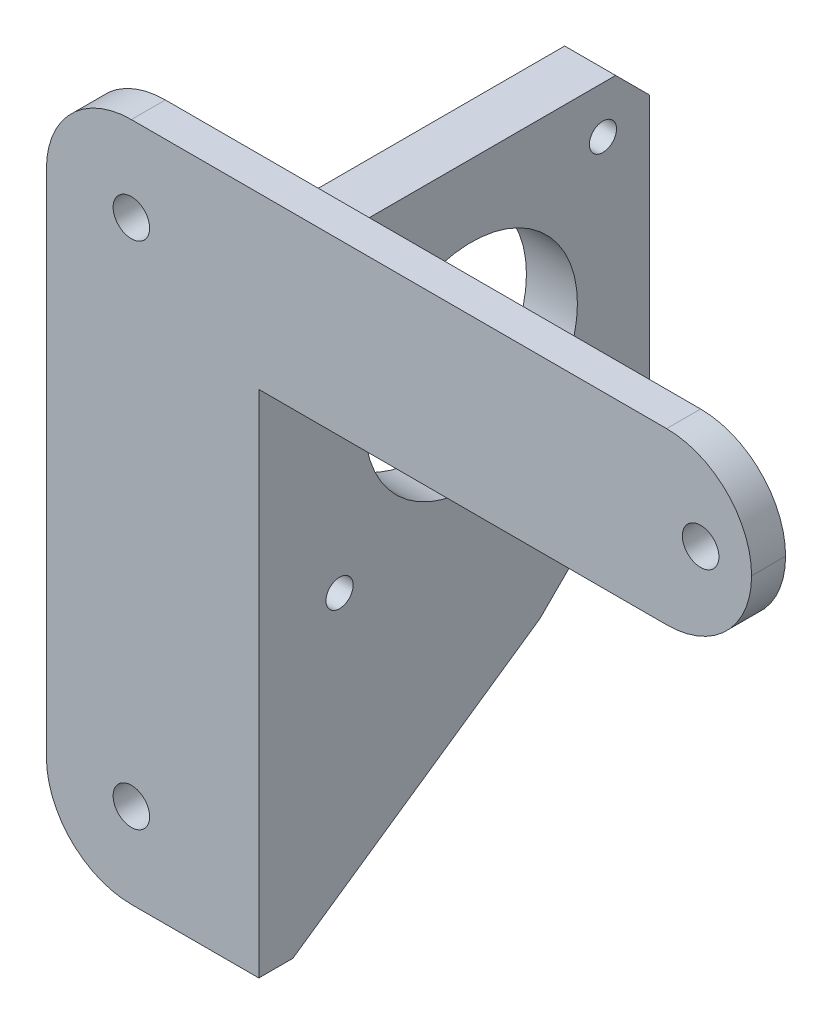
ISO-10303-21;
HEADER;
FILE_DESCRIPTION(('STEP AP214'),'2;1');
FILE_NAME('part.step','',(''),(''),'','','');
FILE_SCHEMA(('AUTOMOTIVE_DESIGN { 1 0 10303 214 1 1 1 1 }'));
ENDSEC;
DATA;
#1=APPLICATION_CONTEXT('core data for automotive mechanical design processes');
#2=APPLICATION_PROTOCOL_DEFINITION('international standard','automotive_design',2000,#1);
#3=PRODUCT_CONTEXT('',#1,'mechanical');
#4=PRODUCT('Part','Part','',(#3));
#5=PRODUCT_RELATED_PRODUCT_CATEGORY('part','',(#4));
#6=PRODUCT_DEFINITION_FORMATION('','',#4);
#7=PRODUCT_DEFINITION_CONTEXT('part definition',#1,'design');
#8=PRODUCT_DEFINITION('design','',#6,#7);
#9=PRODUCT_DEFINITION_SHAPE('','',#8);
#10=(LENGTH_UNIT() NAMED_UNIT(*) SI_UNIT(.MILLI.,.METRE.));
#11=(NAMED_UNIT(*) PLANE_ANGLE_UNIT() SI_UNIT($,.RADIAN.));
#12=(NAMED_UNIT(*) SI_UNIT($,.STERADIAN.) SOLID_ANGLE_UNIT());
#13=UNCERTAINTY_MEASURE_WITH_UNIT(LENGTH_MEASURE(1.E-05),#10,'distance_accuracy_value','');
#14=(GEOMETRIC_REPRESENTATION_CONTEXT(3) GLOBAL_UNCERTAINTY_ASSIGNED_CONTEXT((#13)) GLOBAL_UNIT_ASSIGNED_CONTEXT((#10,
#11,#12)) REPRESENTATION_CONTEXT('',''));
#15=CARTESIAN_POINT('',(0.,0.,0.));
#16=DIRECTION('',(0.,0.,1.));
#17=DIRECTION('',(1.,0.,0.));
#18=AXIS2_PLACEMENT_3D('',#15,#16,#17);
#19=CARTESIAN_POINT('',(0.,0.,0.));
#20=DIRECTION('',(0.,0.,1.));
#21=DIRECTION('',(1.,0.,0.));
#22=AXIS2_PLACEMENT_3D('',#19,#20,#21);
#23=PLANE('',#22);
#24=CARTESIAN_POINT('',(10.,-10.,0.));
#25=DIRECTION('',(0.,0.,1.));
#26=DIRECTION('',(1.,0.,0.));
#27=AXIS2_PLACEMENT_3D('',#24,#25,#26);
#28=CIRCLE('',#27,2.15);
#29=CARTESIAN_POINT('',(12.15,-10.,0.));
#30=VERTEX_POINT('',#29);
#31=EDGE_CURVE('E391',#30,#30,#28,.T.);
#32=ORIENTED_EDGE('',*,*,#31,.T.);
#33=EDGE_LOOP('',(#32));
#34=FACE_BOUND('',#33,.T.);
#35=CARTESIAN_POINT('',(10.,-70.,0.));
#36=DIRECTION('',(0.,0.,1.));
#37=DIRECTION('',(1.,0.,0.));
#38=AXIS2_PLACEMENT_3D('',#35,#36,#37);
#39=CIRCLE('',#38,2.15);
#40=CARTESIAN_POINT('',(12.15,-70.,0.));
#41=VERTEX_POINT('',#40);
#42=EDGE_CURVE('E387',#41,#41,#39,.T.);
#43=ORIENTED_EDGE('',*,*,#42,.T.);
#44=EDGE_LOOP('',(#43));
#45=FACE_BOUND('',#44,.T.);
#46=CARTESIAN_POINT('',(77.,-10.,0.));
#47=DIRECTION('',(0.,0.,1.));
#48=DIRECTION('',(1.,0.,0.));
#49=AXIS2_PLACEMENT_3D('',#46,#47,#48);
#50=CIRCLE('',#49,2.15);
#51=CARTESIAN_POINT('',(79.15,-10.,0.));
#52=VERTEX_POINT('',#51);
#53=EDGE_CURVE('E382',#52,#52,#50,.T.);
#54=ORIENTED_EDGE('',*,*,#53,.T.);
#55=EDGE_LOOP('',(#54));
#56=FACE_BOUND('',#55,.T.);
#57=DIRECTION('',(1.,0.,0.));
#58=VECTOR('',#57,1.);
#59=CARTESIAN_POINT('',(0.,-80.,0.));
#60=LINE('',#59,#58);
#61=CARTESIAN_POINT('',(10.,-80.,0.));
#62=VERTEX_POINT('',#61);
#63=CARTESIAN_POINT('',(17.,-80.,0.));
#64=VERTEX_POINT('',#63);
#65=EDGE_CURVE('E179',#62,#64,#60,.T.);
#66=ORIENTED_EDGE('',*,*,#65,.F.);
#67=CARTESIAN_POINT('',(10.,-70.,0.));
#68=DIRECTION('',(0.,0.,1.));
#69=DIRECTION('',(1.,0.,0.));
#70=AXIS2_PLACEMENT_3D('',#67,#68,#69);
#71=CIRCLE('',#70,10.);
#72=CARTESIAN_POINT('',(0.,-70.,0.));
#73=VERTEX_POINT('',#72);
#74=EDGE_CURVE('E244',#62,#73,#71,.F.);
#75=ORIENTED_EDGE('',*,*,#74,.T.);
#76=DIRECTION('',(0.,-1.,0.));
#77=VECTOR('',#76,1.);
#78=CARTESIAN_POINT('',(0.,0.,0.));
#79=LINE('',#78,#77);
#80=CARTESIAN_POINT('',(0.,-10.,0.));
#81=VERTEX_POINT('',#80);
#82=EDGE_CURVE('E222',#81,#73,#79,.T.);
#83=ORIENTED_EDGE('',*,*,#82,.F.);
#84=CARTESIAN_POINT('',(10.,-10.,0.));
#85=DIRECTION('',(0.,0.,1.));
#86=DIRECTION('',(1.,0.,0.));
#87=AXIS2_PLACEMENT_3D('',#84,#85,#86);
#88=CIRCLE('',#87,10.);
#89=CARTESIAN_POINT('',(9.99999999999999,0.,0.));
#90=VERTEX_POINT('',#89);
#91=EDGE_CURVE('E242',#81,#90,#88,.F.);
#92=ORIENTED_EDGE('',*,*,#91,.T.);
#93=DIRECTION('',(-1.,0.,0.));
#94=VECTOR('',#93,1.);
#95=CARTESIAN_POINT('',(83.,0.,0.));
#96=LINE('',#95,#94);
#97=CARTESIAN_POINT('',(73.,0.,0.));
#98=VERTEX_POINT('',#97);
#99=EDGE_CURVE('E180',#98,#90,#96,.T.);
#100=ORIENTED_EDGE('',*,*,#99,.F.);
#101=CARTESIAN_POINT('',(73.,-10.,0.));
#102=DIRECTION('',(0.,0.,1.));
#103=DIRECTION('',(1.,0.,0.));
#104=AXIS2_PLACEMENT_3D('',#101,#102,#103);
#105=CIRCLE('',#104,10.);
#106=CARTESIAN_POINT('',(83.,-10.,0.));
#107=VERTEX_POINT('',#106);
#108=EDGE_CURVE('E236',#98,#107,#105,.F.);
#109=ORIENTED_EDGE('',*,*,#108,.T.);
#110=CARTESIAN_POINT('',(73.,-10.,0.));
#111=DIRECTION('',(0.,0.,1.));
#112=DIRECTION('',(1.,0.,0.));
#113=AXIS2_PLACEMENT_3D('',#110,#111,#112);
#114=CIRCLE('',#113,10.);
#115=CARTESIAN_POINT('',(73.,-20.,0.));
#116=VERTEX_POINT('',#115);
#117=EDGE_CURVE('E239',#107,#116,#114,.F.);
#118=ORIENTED_EDGE('',*,*,#117,.T.);
#119=DIRECTION('',(1.,0.,0.));
#120=VECTOR('',#119,1.);
#121=CARTESIAN_POINT('',(25.,-20.,0.));
#122=LINE('',#121,#120);
#123=CARTESIAN_POINT('',(25.,-20.,0.));
#124=VERTEX_POINT('',#123);
#125=EDGE_CURVE('E213',#124,#116,#122,.T.);
#126=ORIENTED_EDGE('',*,*,#125,.F.);
#127=DIRECTION('',(0.,-1.,0.));
#128=VECTOR('',#127,1.);
#129=CARTESIAN_POINT('',(25.,-80.,0.));
#130=LINE('',#129,#128);
#131=CARTESIAN_POINT('',(25.,-7.,0.));
#132=VERTEX_POINT('',#131);
#133=EDGE_CURVE('E170',#132,#124,#130,.T.);
#134=ORIENTED_EDGE('',*,*,#133,.F.);
#135=DIRECTION('',(1.,0.,0.));
#136=VECTOR('',#135,1.);
#137=CARTESIAN_POINT('',(0.,-7.,0.));
#138=LINE('',#137,#136);
#139=CARTESIAN_POINT('',(17.,-7.,0.));
#140=VERTEX_POINT('',#139);
#141=EDGE_CURVE('E187',#132,#140,#138,.F.);
#142=ORIENTED_EDGE('',*,*,#141,.T.);
#143=DIRECTION('',(0.,-1.,0.));
#144=VECTOR('',#143,1.);
#145=CARTESIAN_POINT('',(17.,0.,0.));
#146=LINE('',#145,#144);
#147=EDGE_CURVE('E190',#140,#64,#146,.T.);
#148=ORIENTED_EDGE('',*,*,#147,.T.);
#149=EDGE_LOOP('',(#66,#75,#83,#92,#100,#109,#118,#126,#134,#142,#148));
#150=FACE_BOUND('',#149,.T.);
#151=ADVANCED_FACE('F39',(#34,#45,#56,#150),#23,.F.);
#152=CARTESIAN_POINT('',(83.,0.,4.));
#153=DIRECTION('',(0.,-1.,0.));
#154=DIRECTION('',(0.,0.,-1.));
#155=AXIS2_PLACEMENT_3D('',#152,#153,#154);
#156=PLANE('',#155);
#157=ORIENTED_EDGE('',*,*,#99,.T.);
#158=DIRECTION('',(0.,0.,-1.));
#159=VECTOR('',#158,1.);
#160=CARTESIAN_POINT('',(9.99999999999999,0.,4.));
#161=LINE('',#160,#159);
#162=CARTESIAN_POINT('',(9.99999999999999,0.,4.));
#163=VERTEX_POINT('',#162);
#164=EDGE_CURVE('E11',#90,#163,#161,.F.);
#165=ORIENTED_EDGE('',*,*,#164,.T.);
#166=DIRECTION('',(-1.,0.,0.));
#167=VECTOR('',#166,1.);
#168=CARTESIAN_POINT('',(83.,0.,4.));
#169=LINE('',#168,#167);
#170=CARTESIAN_POINT('',(73.,0.,4.));
#171=VERTEX_POINT('',#170);
#172=EDGE_CURVE('E208',#171,#163,#169,.T.);
#173=ORIENTED_EDGE('',*,*,#172,.F.);
#174=DIRECTION('',(0.,0.,-1.));
#175=VECTOR('',#174,1.);
#176=CARTESIAN_POINT('',(73.,0.,4.));
#177=LINE('',#176,#175);
#178=EDGE_CURVE('E48',#171,#98,#177,.T.);
#179=ORIENTED_EDGE('',*,*,#178,.T.);
#180=EDGE_LOOP('',(#157,#165,#173,#179));
#181=FACE_BOUND('',#180,.T.);
#182=ADVANCED_FACE('F269',(#181),#156,.F.);
#183=CARTESIAN_POINT('',(0.,0.,4.));
#184=DIRECTION('',(1.,0.,0.));
#185=DIRECTION('',(0.,0.,-1.));
#186=AXIS2_PLACEMENT_3D('',#183,#184,#185);
#187=PLANE('',#186);
#188=ORIENTED_EDGE('',*,*,#82,.T.);
#189=DIRECTION('',(0.,0.,-1.));
#190=VECTOR('',#189,1.);
#191=CARTESIAN_POINT('',(0.,-70.,4.));
#192=LINE('',#191,#190);
#193=CARTESIAN_POINT('',(0.,-70.,4.));
#194=VERTEX_POINT('',#193);
#195=EDGE_CURVE('E262',#73,#194,#192,.F.);
#196=ORIENTED_EDGE('',*,*,#195,.T.);
#197=DIRECTION('',(0.,-1.,0.));
#198=VECTOR('',#197,1.);
#199=CARTESIAN_POINT('',(0.,0.,4.));
#200=LINE('',#199,#198);
#201=CARTESIAN_POINT('',(0.,-10.,4.));
#202=VERTEX_POINT('',#201);
#203=EDGE_CURVE('E212',#202,#194,#200,.T.);
#204=ORIENTED_EDGE('',*,*,#203,.F.);
#205=DIRECTION('',(0.,0.,-1.));
#206=VECTOR('',#205,1.);
#207=CARTESIAN_POINT('',(0.,-10.,4.));
#208=LINE('',#207,#206);
#209=EDGE_CURVE('E260',#202,#81,#208,.T.);
#210=ORIENTED_EDGE('',*,*,#209,.T.);
#211=EDGE_LOOP('',(#188,#196,#204,#210));
#212=FACE_BOUND('',#211,.T.);
#213=ADVANCED_FACE('F433',(#212),#187,.F.);
#214=CARTESIAN_POINT('',(0.,-80.,4.));
#215=DIRECTION('',(0.,1.,0.));
#216=DIRECTION('',(0.,0.,1.));
#217=AXIS2_PLACEMENT_3D('',#214,#215,#216);
#218=PLANE('',#217);
#219=DIRECTION('',(1.,0.,0.));
#220=VECTOR('',#219,1.);
#221=CARTESIAN_POINT('',(0.,-80.,4.));
#222=LINE('',#221,#220);
#223=CARTESIAN_POINT('',(10.,-80.,4.));
#224=VERTEX_POINT('',#223);
#225=CARTESIAN_POINT('',(25.,-80.,4.));
#226=VERTEX_POINT('',#225);
#227=EDGE_CURVE('E215',#224,#226,#222,.T.);
#228=ORIENTED_EDGE('',*,*,#227,.F.);
#229=DIRECTION('',(0.,0.,-1.));
#230=VECTOR('',#229,1.);
#231=CARTESIAN_POINT('',(10.,-80.,4.));
#232=LINE('',#231,#230);
#233=EDGE_CURVE('E258',#224,#62,#232,.T.);
#234=ORIENTED_EDGE('',*,*,#233,.T.);
#235=ORIENTED_EDGE('',*,*,#65,.T.);
#236=DIRECTION('',(1.,0.,0.));
#237=VECTOR('',#236,1.);
#238=CARTESIAN_POINT('',(19.,-80.,0.));
#239=LINE('',#238,#237);
#240=CARTESIAN_POINT('',(25.,-80.,0.));
#241=VERTEX_POINT('',#240);
#242=EDGE_CURVE('E163',#64,#241,#239,.T.);
#243=ORIENTED_EDGE('',*,*,#242,.T.);
#244=DIRECTION('',(0.,0.,-1.));
#245=VECTOR('',#244,1.);
#246=CARTESIAN_POINT('',(25.,-80.,4.));
#247=LINE('',#246,#245);
#248=EDGE_CURVE('E175',#226,#241,#247,.T.);
#249=ORIENTED_EDGE('',*,*,#248,.F.);
#250=EDGE_LOOP('',(#228,#234,#235,#243,#249));
#251=FACE_BOUND('',#250,.T.);
#252=ADVANCED_FACE('F174',(#251),#218,.F.);
#253=CARTESIAN_POINT('',(25.,-80.,4.));
#254=DIRECTION('',(-1.,0.,0.));
#255=DIRECTION('',(0.,0.,1.));
#256=AXIS2_PLACEMENT_3D('',#253,#254,#255);
#257=PLANE('',#256);
#258=CARTESIAN_POINT('',(25.,-14.5,-5.50000000000001));
#259=DIRECTION('',(1.,0.,0.));
#260=DIRECTION('',(0.,0.,-1.));
#261=AXIS2_PLACEMENT_3D('',#258,#259,#260);
#262=CIRCLE('',#261,1.59999999999999);
#263=CARTESIAN_POINT('',(25.,-14.5,-7.1));
#264=VERTEX_POINT('',#263);
#265=EDGE_CURVE('E379',#264,#264,#262,.T.);
#266=ORIENTED_EDGE('',*,*,#265,.F.);
#267=EDGE_LOOP('',(#266));
#268=FACE_BOUND('',#267,.T.);
#269=CARTESIAN_POINT('',(25.,-14.5,-36.5));
#270=DIRECTION('',(1.,0.,0.));
#271=DIRECTION('',(0.,0.,-1.));
#272=AXIS2_PLACEMENT_3D('',#269,#270,#271);
#273=CIRCLE('',#272,1.59999999999999);
#274=CARTESIAN_POINT('',(25.,-14.5,-38.1));
#275=VERTEX_POINT('',#274);
#276=EDGE_CURVE('E373',#275,#275,#273,.T.);
#277=ORIENTED_EDGE('',*,*,#276,.F.);
#278=EDGE_LOOP('',(#277));
#279=FACE_BOUND('',#278,.T.);
#280=CARTESIAN_POINT('',(25.,-45.5,-36.5));
#281=DIRECTION('',(1.,0.,0.));
#282=DIRECTION('',(0.,0.,-1.));
#283=AXIS2_PLACEMENT_3D('',#280,#281,#282);
#284=CIRCLE('',#283,1.59999999999999);
#285=CARTESIAN_POINT('',(25.,-45.5,-38.1));
#286=VERTEX_POINT('',#285);
#287=EDGE_CURVE('E367',#286,#286,#284,.T.);
#288=ORIENTED_EDGE('',*,*,#287,.F.);
#289=EDGE_LOOP('',(#288));
#290=FACE_BOUND('',#289,.T.);
#291=CARTESIAN_POINT('',(25.,-45.5,-5.50000000000001));
#292=DIRECTION('',(1.,0.,0.));
#293=DIRECTION('',(0.,0.,-1.));
#294=AXIS2_PLACEMENT_3D('',#291,#292,#293);
#295=CIRCLE('',#294,1.59999999999999);
#296=CARTESIAN_POINT('',(25.,-45.5,-7.1));
#297=VERTEX_POINT('',#296);
#298=EDGE_CURVE('E361',#297,#297,#295,.T.);
#299=ORIENTED_EDGE('',*,*,#298,.F.);
#300=EDGE_LOOP('',(#299));
#301=FACE_BOUND('',#300,.T.);
#302=DIRECTION('',(0.,0.568190717082642,-0.822896900602447));
#303=VECTOR('',#302,1.);
#304=CARTESIAN_POINT('',(25.,-51.,-42.));
#305=LINE('',#304,#303);
#306=CARTESIAN_POINT('',(25.,-59.9230769230768,-29.0769230769233));
#307=VERTEX_POINT('',#306);
#308=EDGE_CURVE('E159',#241,#307,#305,.T.);
#309=ORIENTED_EDGE('',*,*,#308,.T.);
#310=DIRECTION('',(0.,-0.707106781186549,0.707106781186546));
#311=VECTOR('',#310,1.);
#312=CARTESIAN_POINT('',(25.,-59.9230769230768,-29.0769230769232));
#313=LINE('',#312,#311);
#314=CARTESIAN_POINT('',(25.,-47.,-42.));
#315=VERTEX_POINT('',#314);
#316=EDGE_CURVE('E321',#307,#315,#313,.F.);
#317=ORIENTED_EDGE('',*,*,#316,.T.);
#318=DIRECTION('',(0.,1.,0.));
#319=VECTOR('',#318,1.);
#320=CARTESIAN_POINT('',(25.,-9.,-42.));
#321=LINE('',#320,#319);
#322=CARTESIAN_POINT('',(25.,-13.,-42.));
#323=VERTEX_POINT('',#322);
#324=EDGE_CURVE('E169',#315,#323,#321,.T.);
#325=ORIENTED_EDGE('',*,*,#324,.T.);
#326=DIRECTION('',(0.,-0.707106781186546,-0.707106781186549));
#327=VECTOR('',#326,1.);
#328=CARTESIAN_POINT('',(25.,-13.,-42.));
#329=LINE('',#328,#327);
#330=CARTESIAN_POINT('',(25.,-9.,-38.));
#331=VERTEX_POINT('',#330);
#332=EDGE_CURVE('E319',#323,#331,#329,.F.);
#333=ORIENTED_EDGE('',*,*,#332,.T.);
#334=DIRECTION('',(0.,0.,1.));
#335=VECTOR('',#334,1.);
#336=CARTESIAN_POINT('',(25.,-9.,0.));
#337=LINE('',#336,#335);
#338=CARTESIAN_POINT('',(25.,-9.,-2.));
#339=VERTEX_POINT('',#338);
#340=EDGE_CURVE('E206',#331,#339,#337,.T.);
#341=ORIENTED_EDGE('',*,*,#340,.T.);
#342=CARTESIAN_POINT('',(25.,-7.,-2.));
#343=DIRECTION('',(-1.,0.,0.));
#344=DIRECTION('',(0.,0.,1.));
#345=AXIS2_PLACEMENT_3D('',#342,#343,#344);
#346=CIRCLE('',#345,2.);
#347=EDGE_CURVE('E289',#339,#132,#346,.T.);
#348=ORIENTED_EDGE('',*,*,#347,.T.);
#349=ORIENTED_EDGE('',*,*,#133,.T.);
#350=DIRECTION('',(0.,0.,-1.));
#351=VECTOR('',#350,1.);
#352=CARTESIAN_POINT('',(25.,-20.,4.));
#353=LINE('',#352,#351);
#354=CARTESIAN_POINT('',(25.,-20.,4.));
#355=VERTEX_POINT('',#354);
#356=EDGE_CURVE('E188',#355,#124,#353,.T.);
#357=ORIENTED_EDGE('',*,*,#356,.F.);
#358=DIRECTION('',(0.,1.,0.));
#359=VECTOR('',#358,1.);
#360=CARTESIAN_POINT('',(25.,-80.,4.));
#361=LINE('',#360,#359);
#362=EDGE_CURVE('E186',#226,#355,#361,.T.);
#363=ORIENTED_EDGE('',*,*,#362,.F.);
#364=ORIENTED_EDGE('',*,*,#248,.T.);
#365=EDGE_LOOP('',(#309,#317,#325,#333,#341,#348,#349,#357,#363,#364));
#366=FACE_BOUND('',#365,.T.);
#367=CARTESIAN_POINT('',(25.,-30.,-21.));
#368=DIRECTION('',(1.,0.,0.));
#369=DIRECTION('',(0.,0.,-1.));
#370=AXIS2_PLACEMENT_3D('',#367,#368,#369);
#371=CIRCLE('',#370,12.5);
#372=CARTESIAN_POINT('',(25.,-30.,-33.5));
#373=VERTEX_POINT('',#372);
#374=EDGE_CURVE('E353',#373,#373,#371,.T.);
#375=ORIENTED_EDGE('',*,*,#374,.F.);
#376=EDGE_LOOP('',(#375));
#377=FACE_BOUND('',#376,.T.);
#378=ADVANCED_FACE('F183',(#268,#279,#290,#301,#366,#377),#257,.F.);
#379=CARTESIAN_POINT('',(25.,-20.,4.));
#380=DIRECTION('',(0.,1.,0.));
#381=DIRECTION('',(0.,0.,1.));
#382=AXIS2_PLACEMENT_3D('',#379,#380,#381);
#383=PLANE('',#382);
#384=ORIENTED_EDGE('',*,*,#125,.T.);
#385=DIRECTION('',(0.,0.,-1.));
#386=VECTOR('',#385,1.);
#387=CARTESIAN_POINT('',(73.,-20.,4.));
#388=LINE('',#387,#386);
#389=CARTESIAN_POINT('',(73.,-20.,4.));
#390=VERTEX_POINT('',#389);
#391=EDGE_CURVE('E246',#116,#390,#388,.F.);
#392=ORIENTED_EDGE('',*,*,#391,.T.);
#393=DIRECTION('',(1.,0.,0.));
#394=VECTOR('',#393,1.);
#395=CARTESIAN_POINT('',(25.,-20.,4.));
#396=LINE('',#395,#394);
#397=EDGE_CURVE('E193',#355,#390,#396,.T.);
#398=ORIENTED_EDGE('',*,*,#397,.F.);
#399=ORIENTED_EDGE('',*,*,#356,.T.);
#400=EDGE_LOOP('',(#384,#392,#398,#399));
#401=FACE_BOUND('',#400,.T.);
#402=ADVANCED_FACE('F285',(#401),#383,.F.);
#403=CARTESIAN_POINT('',(0.,0.,4.));
#404=DIRECTION('',(0.,0.,1.));
#405=DIRECTION('',(1.,0.,0.));
#406=AXIS2_PLACEMENT_3D('',#403,#404,#405);
#407=PLANE('',#406);
#408=CARTESIAN_POINT('',(10.,-10.,4.));
#409=DIRECTION('',(0.,0.,1.));
#410=DIRECTION('',(1.,0.,0.));
#411=AXIS2_PLACEMENT_3D('',#408,#409,#410);
#412=CIRCLE('',#411,2.15);
#413=CARTESIAN_POINT('',(12.15,-10.,4.));
#414=VERTEX_POINT('',#413);
#415=EDGE_CURVE('E302',#414,#414,#412,.T.);
#416=ORIENTED_EDGE('',*,*,#415,.F.);
#417=EDGE_LOOP('',(#416));
#418=FACE_BOUND('',#417,.T.);
#419=CARTESIAN_POINT('',(10.,-70.,4.));
#420=DIRECTION('',(0.,0.,1.));
#421=DIRECTION('',(1.,0.,0.));
#422=AXIS2_PLACEMENT_3D('',#419,#420,#421);
#423=CIRCLE('',#422,2.15);
#424=CARTESIAN_POINT('',(12.15,-70.,4.));
#425=VERTEX_POINT('',#424);
#426=EDGE_CURVE('E388',#425,#425,#423,.T.);
#427=ORIENTED_EDGE('',*,*,#426,.F.);
#428=EDGE_LOOP('',(#427));
#429=FACE_BOUND('',#428,.T.);
#430=CARTESIAN_POINT('',(77.,-10.,4.));
#431=DIRECTION('',(0.,0.,1.));
#432=DIRECTION('',(1.,0.,0.));
#433=AXIS2_PLACEMENT_3D('',#430,#431,#432);
#434=CIRCLE('',#433,2.15);
#435=CARTESIAN_POINT('',(79.15,-10.,4.));
#436=VERTEX_POINT('',#435);
#437=EDGE_CURVE('E383',#436,#436,#434,.T.);
#438=ORIENTED_EDGE('',*,*,#437,.F.);
#439=EDGE_LOOP('',(#438));
#440=FACE_BOUND('',#439,.T.);
#441=ORIENTED_EDGE('',*,*,#203,.T.);
#442=CARTESIAN_POINT('',(10.,-70.,4.));
#443=DIRECTION('',(0.,0.,1.));
#444=DIRECTION('',(1.,0.,0.));
#445=AXIS2_PLACEMENT_3D('',#442,#443,#444);
#446=CIRCLE('',#445,10.);
#447=EDGE_CURVE('E65',#194,#224,#446,.T.);
#448=ORIENTED_EDGE('',*,*,#447,.T.);
#449=ORIENTED_EDGE('',*,*,#227,.T.);
#450=ORIENTED_EDGE('',*,*,#362,.T.);
#451=ORIENTED_EDGE('',*,*,#397,.T.);
#452=CARTESIAN_POINT('',(73.,-10.,4.));
#453=DIRECTION('',(0.,0.,1.));
#454=DIRECTION('',(1.,0.,0.));
#455=AXIS2_PLACEMENT_3D('',#452,#453,#454);
#456=CIRCLE('',#455,10.);
#457=CARTESIAN_POINT('',(83.,-10.,4.));
#458=VERTEX_POINT('',#457);
#459=EDGE_CURVE('E58',#390,#458,#456,.T.);
#460=ORIENTED_EDGE('',*,*,#459,.T.);
#461=CARTESIAN_POINT('',(73.,-10.,4.));
#462=DIRECTION('',(0.,0.,1.));
#463=DIRECTION('',(1.,0.,0.));
#464=AXIS2_PLACEMENT_3D('',#461,#462,#463);
#465=CIRCLE('',#464,10.);
#466=EDGE_CURVE('E250',#458,#171,#465,.T.);
#467=ORIENTED_EDGE('',*,*,#466,.T.);
#468=ORIENTED_EDGE('',*,*,#172,.T.);
#469=CARTESIAN_POINT('',(10.,-10.,4.));
#470=DIRECTION('',(0.,0.,1.));
#471=DIRECTION('',(1.,0.,0.));
#472=AXIS2_PLACEMENT_3D('',#469,#470,#471);
#473=CIRCLE('',#472,10.);
#474=EDGE_CURVE('E255',#163,#202,#473,.T.);
#475=ORIENTED_EDGE('',*,*,#474,.T.);
#476=EDGE_LOOP('',(#441,#448,#449,#450,#451,#460,#467,#468,#475));
#477=FACE_BOUND('',#476,.T.);
#478=ADVANCED_FACE('F438',(#418,#429,#440,#477),#407,.T.);
#479=CARTESIAN_POINT('',(19.,-9.,0.));
#480=DIRECTION('',(0.,1.,0.));
#481=DIRECTION('',(0.,0.,1.));
#482=AXIS2_PLACEMENT_3D('',#479,#480,#481);
#483=PLANE('',#482);
#484=ORIENTED_EDGE('',*,*,#340,.F.);
#485=DIRECTION('',(-1.,0.,0.));
#486=VECTOR('',#485,1.);
#487=CARTESIAN_POINT('',(19.,-9.,-38.));
#488=LINE('',#487,#486);
#489=CARTESIAN_POINT('',(19.,-9.,-38.));
#490=VERTEX_POINT('',#489);
#491=EDGE_CURVE('E234',#331,#490,#488,.T.);
#492=ORIENTED_EDGE('',*,*,#491,.T.);
#493=DIRECTION('',(0.,0.,1.));
#494=VECTOR('',#493,1.);
#495=CARTESIAN_POINT('',(19.,-9.,0.));
#496=LINE('',#495,#494);
#497=CARTESIAN_POINT('',(19.,-9.,-2.));
#498=VERTEX_POINT('',#497);
#499=EDGE_CURVE('E181',#490,#498,#496,.T.);
#500=ORIENTED_EDGE('',*,*,#499,.T.);
#501=DIRECTION('',(1.,0.,0.));
#502=VECTOR('',#501,1.);
#503=CARTESIAN_POINT('',(19.,-9.,-2.));
#504=LINE('',#503,#502);
#505=EDGE_CURVE('E299',#498,#339,#504,.T.);
#506=ORIENTED_EDGE('',*,*,#505,.T.);
#507=EDGE_LOOP('',(#484,#492,#500,#506));
#508=FACE_BOUND('',#507,.T.);
#509=ADVANCED_FACE('F338',(#508),#483,.T.);
#510=CARTESIAN_POINT('',(19.,-9.,-42.));
#511=DIRECTION('',(0.,0.,-1.));
#512=DIRECTION('',(0.,1.,0.));
#513=AXIS2_PLACEMENT_3D('',#510,#511,#512);
#514=PLANE('',#513);
#515=ORIENTED_EDGE('',*,*,#324,.F.);
#516=DIRECTION('',(-1.,0.,0.));
#517=VECTOR('',#516,1.);
#518=CARTESIAN_POINT('',(19.,-47.,-42.));
#519=LINE('',#518,#517);
#520=CARTESIAN_POINT('',(19.,-47.,-42.));
#521=VERTEX_POINT('',#520);
#522=EDGE_CURVE('E326',#315,#521,#519,.T.);
#523=ORIENTED_EDGE('',*,*,#522,.T.);
#524=DIRECTION('',(0.,1.,0.));
#525=VECTOR('',#524,1.);
#526=CARTESIAN_POINT('',(19.,-9.,-42.));
#527=LINE('',#526,#525);
#528=CARTESIAN_POINT('',(19.,-13.,-42.));
#529=VERTEX_POINT('',#528);
#530=EDGE_CURVE('E313',#521,#529,#527,.T.);
#531=ORIENTED_EDGE('',*,*,#530,.T.);
#532=DIRECTION('',(1.,0.,0.));
#533=VECTOR('',#532,1.);
#534=CARTESIAN_POINT('',(19.,-13.,-42.));
#535=LINE('',#534,#533);
#536=EDGE_CURVE('E323',#529,#323,#535,.T.);
#537=ORIENTED_EDGE('',*,*,#536,.T.);
#538=EDGE_LOOP('',(#515,#523,#531,#537));
#539=FACE_BOUND('',#538,.T.);
#540=ADVANCED_FACE('F349',(#539),#514,.T.);
#541=CARTESIAN_POINT('',(19.,-51.,-42.));
#542=DIRECTION('',(0.,-0.822896900602447,-0.568190717082641));
#543=DIRECTION('',(0.,0.568190717082642,-0.822896900602447));
#544=AXIS2_PLACEMENT_3D('',#541,#542,#543);
#545=PLANE('',#544);
#546=DIRECTION('',(0.,0.568190717082642,-0.822896900602447));
#547=VECTOR('',#546,1.);
#548=CARTESIAN_POINT('',(19.,-51.,-42.));
#549=LINE('',#548,#547);
#550=CARTESIAN_POINT('',(19.,-78.6190476190476,-1.99999999999999));
#551=VERTEX_POINT('',#550);
#552=CARTESIAN_POINT('',(19.,-59.9230769230768,-29.0769230769233));
#553=VERTEX_POINT('',#552);
#554=EDGE_CURVE('E312',#551,#553,#549,.T.);
#555=ORIENTED_EDGE('',*,*,#554,.T.);
#556=DIRECTION('',(1.,0.,0.));
#557=VECTOR('',#556,1.);
#558=CARTESIAN_POINT('',(19.,-59.9230769230768,-29.0769230769232));
#559=LINE('',#558,#557);
#560=EDGE_CURVE('E166',#553,#307,#559,.T.);
#561=ORIENTED_EDGE('',*,*,#560,.T.);
#562=ORIENTED_EDGE('',*,*,#308,.F.);
#563=ORIENTED_EDGE('',*,*,#242,.F.);
#564=CARTESIAN_POINT('',(17.,-78.6190476190476,-2.));
#565=DIRECTION('',(0.,-0.822896900602447,-0.568190717082641));
#566=DIRECTION('',(0.,-0.568190717082642,0.822896900602447));
#567=AXIS2_PLACEMENT_3D('',#564,#565,#566);
#568=ELLIPSE('',#567,2.43043812479521,2.);
#569=EDGE_CURVE('E305',#64,#551,#568,.F.);
#570=ORIENTED_EDGE('',*,*,#569,.T.);
#571=EDGE_LOOP('',(#555,#561,#562,#563,#570));
#572=FACE_BOUND('',#571,.T.);
#573=ADVANCED_FACE('F162',(#572),#545,.T.);
#574=CARTESIAN_POINT('',(19.,0.,0.));
#575=DIRECTION('',(-1.,0.,0.));
#576=DIRECTION('',(0.,0.,1.));
#577=AXIS2_PLACEMENT_3D('',#574,#575,#576);
#578=PLANE('',#577);
#579=CARTESIAN_POINT('',(19.,-14.5,-5.50000000000001));
#580=DIRECTION('',(-1.,0.,0.));
#581=DIRECTION('',(0.,0.,1.));
#582=AXIS2_PLACEMENT_3D('',#579,#580,#581);
#583=CIRCLE('',#582,1.59999999999999);
#584=CARTESIAN_POINT('',(19.,-14.5,-3.90000000000002));
#585=VERTEX_POINT('',#584);
#586=EDGE_CURVE('E376',#585,#585,#583,.T.);
#587=ORIENTED_EDGE('',*,*,#586,.F.);
#588=EDGE_LOOP('',(#587));
#589=FACE_BOUND('',#588,.T.);
#590=CARTESIAN_POINT('',(19.,-14.5,-36.5));
#591=DIRECTION('',(-1.,0.,0.));
#592=DIRECTION('',(0.,0.,1.));
#593=AXIS2_PLACEMENT_3D('',#590,#591,#592);
#594=CIRCLE('',#593,1.59999999999999);
#595=CARTESIAN_POINT('',(19.,-14.5,-34.9));
#596=VERTEX_POINT('',#595);
#597=EDGE_CURVE('E370',#596,#596,#594,.T.);
#598=ORIENTED_EDGE('',*,*,#597,.F.);
#599=EDGE_LOOP('',(#598));
#600=FACE_BOUND('',#599,.T.);
#601=CARTESIAN_POINT('',(19.,-45.5,-36.5));
#602=DIRECTION('',(-1.,0.,0.));
#603=DIRECTION('',(0.,0.,1.));
#604=AXIS2_PLACEMENT_3D('',#601,#602,#603);
#605=CIRCLE('',#604,1.59999999999999);
#606=CARTESIAN_POINT('',(19.,-45.5,-34.9));
#607=VERTEX_POINT('',#606);
#608=EDGE_CURVE('E364',#607,#607,#605,.T.);
#609=ORIENTED_EDGE('',*,*,#608,.F.);
#610=EDGE_LOOP('',(#609));
#611=FACE_BOUND('',#610,.T.);
#612=CARTESIAN_POINT('',(19.,-45.5,-5.50000000000001));
#613=DIRECTION('',(-1.,0.,0.));
#614=DIRECTION('',(0.,0.,1.));
#615=AXIS2_PLACEMENT_3D('',#612,#613,#614);
#616=CIRCLE('',#615,1.59999999999999);
#617=CARTESIAN_POINT('',(19.,-45.5,-3.90000000000002));
#618=VERTEX_POINT('',#617);
#619=EDGE_CURVE('E356',#618,#618,#616,.T.);
#620=ORIENTED_EDGE('',*,*,#619,.F.);
#621=EDGE_LOOP('',(#620));
#622=FACE_BOUND('',#621,.T.);
#623=CARTESIAN_POINT('',(19.,-30.,-21.));
#624=DIRECTION('',(1.,0.,0.));
#625=DIRECTION('',(0.,0.,-1.));
#626=AXIS2_PLACEMENT_3D('',#623,#624,#625);
#627=CIRCLE('',#626,12.5);
#628=CARTESIAN_POINT('',(19.,-30.,-33.5));
#629=VERTEX_POINT('',#628);
#630=EDGE_CURVE('E205',#629,#629,#627,.T.);
#631=ORIENTED_EDGE('',*,*,#630,.T.);
#632=EDGE_LOOP('',(#631));
#633=FACE_BOUND('',#632,.T.);
#634=ORIENTED_EDGE('',*,*,#530,.F.);
#635=DIRECTION('',(0.,0.707106781186549,-0.707106781186546));
#636=VECTOR('',#635,1.);
#637=CARTESIAN_POINT('',(19.,-44.4999999999999,-44.5000000000001));
#638=LINE('',#637,#636);
#639=EDGE_CURVE('E329',#521,#553,#638,.F.);
#640=ORIENTED_EDGE('',*,*,#639,.T.);
#641=ORIENTED_EDGE('',*,*,#554,.F.);
#642=DIRECTION('',(0.,-1.,0.));
#643=VECTOR('',#642,1.);
#644=CARTESIAN_POINT('',(19.,0.,-2.));
#645=LINE('',#644,#643);
#646=EDGE_CURVE('E306',#551,#498,#645,.F.);
#647=ORIENTED_EDGE('',*,*,#646,.T.);
#648=ORIENTED_EDGE('',*,*,#499,.F.);
#649=DIRECTION('',(0.,0.707106781186546,0.707106781186549));
#650=VECTOR('',#649,1.);
#651=CARTESIAN_POINT('',(19.,14.5,-14.4999999999999));
#652=LINE('',#651,#650);
#653=EDGE_CURVE('E328',#490,#529,#652,.F.);
#654=ORIENTED_EDGE('',*,*,#653,.T.);
#655=EDGE_LOOP('',(#634,#640,#641,#647,#648,#654));
#656=FACE_BOUND('',#655,.T.);
#657=ADVANCED_FACE('F341',(#589,#600,#611,#622,#633,#656),#578,.T.);
#658=CARTESIAN_POINT('',(19.,-30.,-21.));
#659=DIRECTION('',(1.,0.,0.));
#660=DIRECTION('',(0.,0.,-1.));
#661=AXIS2_PLACEMENT_3D('',#658,#659,#660);
#662=CYLINDRICAL_SURFACE('',#661,12.5);
#663=ORIENTED_EDGE('',*,*,#630,.F.);
#664=EDGE_LOOP('',(#663));
#665=FACE_BOUND('',#664,.T.);
#666=ORIENTED_EDGE('',*,*,#374,.T.);
#667=EDGE_LOOP('',(#666));
#668=FACE_BOUND('',#667,.T.);
#669=ADVANCED_FACE('F493',(#665,#668),#662,.F.);
#670=CARTESIAN_POINT('',(25.,-45.5,-5.50000000000001));
#671=DIRECTION('',(1.,0.,0.));
#672=DIRECTION('',(0.,0.,-1.));
#673=AXIS2_PLACEMENT_3D('',#670,#671,#672);
#674=CYLINDRICAL_SURFACE('',#673,1.59999999999999);
#675=ORIENTED_EDGE('',*,*,#619,.T.);
#676=EDGE_LOOP('',(#675));
#677=FACE_BOUND('',#676,.T.);
#678=ORIENTED_EDGE('',*,*,#298,.T.);
#679=EDGE_LOOP('',(#678));
#680=FACE_BOUND('',#679,.T.);
#681=ADVANCED_FACE('F498',(#677,#680),#674,.F.);
#682=CARTESIAN_POINT('',(25.,-45.5,-36.5));
#683=DIRECTION('',(1.,0.,0.));
#684=DIRECTION('',(0.,0.,-1.));
#685=AXIS2_PLACEMENT_3D('',#682,#683,#684);
#686=CYLINDRICAL_SURFACE('',#685,1.59999999999999);
#687=ORIENTED_EDGE('',*,*,#608,.T.);
#688=EDGE_LOOP('',(#687));
#689=FACE_BOUND('',#688,.T.);
#690=ORIENTED_EDGE('',*,*,#287,.T.);
#691=EDGE_LOOP('',(#690));
#692=FACE_BOUND('',#691,.T.);
#693=ADVANCED_FACE('F514',(#689,#692),#686,.F.);
#694=CARTESIAN_POINT('',(25.,-14.5,-36.5));
#695=DIRECTION('',(1.,0.,0.));
#696=DIRECTION('',(0.,0.,-1.));
#697=AXIS2_PLACEMENT_3D('',#694,#695,#696);
#698=CYLINDRICAL_SURFACE('',#697,1.59999999999999);
#699=ORIENTED_EDGE('',*,*,#597,.T.);
#700=EDGE_LOOP('',(#699));
#701=FACE_BOUND('',#700,.T.);
#702=ORIENTED_EDGE('',*,*,#276,.T.);
#703=EDGE_LOOP('',(#702));
#704=FACE_BOUND('',#703,.T.);
#705=ADVANCED_FACE('F425',(#701,#704),#698,.F.);
#706=CARTESIAN_POINT('',(25.,-14.5,-5.50000000000001));
#707=DIRECTION('',(1.,0.,0.));
#708=DIRECTION('',(0.,0.,-1.));
#709=AXIS2_PLACEMENT_3D('',#706,#707,#708);
#710=CYLINDRICAL_SURFACE('',#709,1.59999999999999);
#711=ORIENTED_EDGE('',*,*,#586,.T.);
#712=EDGE_LOOP('',(#711));
#713=FACE_BOUND('',#712,.T.);
#714=ORIENTED_EDGE('',*,*,#265,.T.);
#715=EDGE_LOOP('',(#714));
#716=FACE_BOUND('',#715,.T.);
#717=ADVANCED_FACE('F415',(#713,#716),#710,.F.);
#718=CARTESIAN_POINT('',(77.,-10.,4.));
#719=DIRECTION('',(0.,0.,1.));
#720=DIRECTION('',(1.,0.,0.));
#721=AXIS2_PLACEMENT_3D('',#718,#719,#720);
#722=CYLINDRICAL_SURFACE('',#721,2.15);
#723=ORIENTED_EDGE('',*,*,#437,.T.);
#724=EDGE_LOOP('',(#723));
#725=FACE_BOUND('',#724,.T.);
#726=ORIENTED_EDGE('',*,*,#53,.F.);
#727=EDGE_LOOP('',(#726));
#728=FACE_BOUND('',#727,.T.);
#729=ADVANCED_FACE('F412',(#725,#728),#722,.F.);
#730=CARTESIAN_POINT('',(10.,-70.,4.));
#731=DIRECTION('',(0.,0.,1.));
#732=DIRECTION('',(1.,0.,0.));
#733=AXIS2_PLACEMENT_3D('',#730,#731,#732);
#734=CYLINDRICAL_SURFACE('',#733,2.15);
#735=ORIENTED_EDGE('',*,*,#426,.T.);
#736=EDGE_LOOP('',(#735));
#737=FACE_BOUND('',#736,.T.);
#738=ORIENTED_EDGE('',*,*,#42,.F.);
#739=EDGE_LOOP('',(#738));
#740=FACE_BOUND('',#739,.T.);
#741=ADVANCED_FACE('F414',(#737,#740),#734,.F.);
#742=CARTESIAN_POINT('',(10.,-10.,4.));
#743=DIRECTION('',(0.,0.,1.));
#744=DIRECTION('',(1.,0.,0.));
#745=AXIS2_PLACEMENT_3D('',#742,#743,#744);
#746=CYLINDRICAL_SURFACE('',#745,2.15);
#747=ORIENTED_EDGE('',*,*,#415,.T.);
#748=EDGE_LOOP('',(#747));
#749=FACE_BOUND('',#748,.T.);
#750=ORIENTED_EDGE('',*,*,#31,.F.);
#751=EDGE_LOOP('',(#750));
#752=FACE_BOUND('',#751,.T.);
#753=ADVANCED_FACE('F422',(#749,#752),#746,.F.);
#754=CARTESIAN_POINT('',(19.,-7.,-2.));
#755=DIRECTION('',(1.,0.,0.));
#756=DIRECTION('',(0.,0.,-1.));
#757=AXIS2_PLACEMENT_3D('',#754,#755,#756);
#758=CYLINDRICAL_SURFACE('',#757,2.);
#759=ORIENTED_EDGE('',*,*,#347,.F.);
#760=ORIENTED_EDGE('',*,*,#505,.F.);
#761=CARTESIAN_POINT('',(17.,-7.,-2.));
#762=DIRECTION('',(0.707106781186547,0.707106781186547,0.));
#763=DIRECTION('',(0.707106781186547,-0.707106781186547,0.));
#764=AXIS2_PLACEMENT_3D('',#761,#762,#763);
#765=ELLIPSE('',#764,2.82842712474619,2.);
#766=EDGE_CURVE('E280',#140,#498,#765,.T.);
#767=ORIENTED_EDGE('',*,*,#766,.F.);
#768=ORIENTED_EDGE('',*,*,#141,.F.);
#769=EDGE_LOOP('',(#759,#760,#767,#768));
#770=FACE_BOUND('',#769,.T.);
#771=ADVANCED_FACE('F297',(#770),#758,.F.);
#772=CARTESIAN_POINT('',(17.,0.,-2.));
#773=DIRECTION('',(0.,-1.,0.));
#774=DIRECTION('',(0.,0.,-1.));
#775=AXIS2_PLACEMENT_3D('',#772,#773,#774);
#776=CYLINDRICAL_SURFACE('',#775,2.);
#777=ORIENTED_EDGE('',*,*,#766,.T.);
#778=ORIENTED_EDGE('',*,*,#646,.F.);
#779=ORIENTED_EDGE('',*,*,#569,.F.);
#780=ORIENTED_EDGE('',*,*,#147,.F.);
#781=EDGE_LOOP('',(#777,#778,#779,#780));
#782=FACE_BOUND('',#781,.T.);
#783=ADVANCED_FACE('F304',(#782),#776,.F.);
#784=CARTESIAN_POINT('',(19.,-59.9230769230768,-29.0769230769232));
#785=DIRECTION('',(0.,0.707106781186546,0.707106781186549));
#786=DIRECTION('',(1.,0.,0.));
#787=AXIS2_PLACEMENT_3D('',#784,#785,#786);
#788=PLANE('',#787);
#789=ORIENTED_EDGE('',*,*,#639,.F.);
#790=ORIENTED_EDGE('',*,*,#522,.F.);
#791=ORIENTED_EDGE('',*,*,#316,.F.);
#792=ORIENTED_EDGE('',*,*,#560,.F.);
#793=EDGE_LOOP('',(#789,#790,#791,#792));
#794=FACE_BOUND('',#793,.T.);
#795=ADVANCED_FACE('F451',(#794),#788,.F.);
#796=CARTESIAN_POINT('',(19.,-13.,-42.));
#797=DIRECTION('',(0.,-0.707106781186549,0.707106781186546));
#798=DIRECTION('',(1.,0.,0.));
#799=AXIS2_PLACEMENT_3D('',#796,#797,#798);
#800=PLANE('',#799);
#801=ORIENTED_EDGE('',*,*,#653,.F.);
#802=ORIENTED_EDGE('',*,*,#491,.F.);
#803=ORIENTED_EDGE('',*,*,#332,.F.);
#804=ORIENTED_EDGE('',*,*,#536,.F.);
#805=EDGE_LOOP('',(#801,#802,#803,#804));
#806=FACE_BOUND('',#805,.T.);
#807=ADVANCED_FACE('F345',(#806),#800,.F.);
#808=CARTESIAN_POINT('',(73.,-10.,4.));
#809=DIRECTION('',(0.,0.,-1.));
#810=DIRECTION('',(-1.,0.,0.));
#811=AXIS2_PLACEMENT_3D('',#808,#809,#810);
#812=CYLINDRICAL_SURFACE('',#811,10.);
#813=ORIENTED_EDGE('',*,*,#178,.F.);
#814=ORIENTED_EDGE('',*,*,#466,.F.);
#815=DIRECTION('',(0.,0.,-1.));
#816=VECTOR('',#815,1.);
#817=CARTESIAN_POINT('',(83.,-10.,4.));
#818=LINE('',#817,#816);
#819=EDGE_CURVE('E43',#107,#458,#818,.F.);
#820=ORIENTED_EDGE('',*,*,#819,.F.);
#821=ORIENTED_EDGE('',*,*,#108,.F.);
#822=EDGE_LOOP('',(#813,#814,#820,#821));
#823=FACE_BOUND('',#822,.T.);
#824=ADVANCED_FACE('F275',(#823),#812,.T.);
#825=CARTESIAN_POINT('',(73.,-10.,4.));
#826=DIRECTION('',(0.,0.,-1.));
#827=DIRECTION('',(-1.,0.,0.));
#828=AXIS2_PLACEMENT_3D('',#825,#826,#827);
#829=CYLINDRICAL_SURFACE('',#828,10.);
#830=ORIENTED_EDGE('',*,*,#459,.F.);
#831=ORIENTED_EDGE('',*,*,#391,.F.);
#832=ORIENTED_EDGE('',*,*,#117,.F.);
#833=ORIENTED_EDGE('',*,*,#819,.T.);
#834=EDGE_LOOP('',(#830,#831,#832,#833));
#835=FACE_BOUND('',#834,.T.);
#836=ADVANCED_FACE('F282',(#835),#829,.T.);
#837=CARTESIAN_POINT('',(10.,-70.,4.));
#838=DIRECTION('',(0.,0.,-1.));
#839=DIRECTION('',(-1.,0.,0.));
#840=AXIS2_PLACEMENT_3D('',#837,#838,#839);
#841=CYLINDRICAL_SURFACE('',#840,10.);
#842=ORIENTED_EDGE('',*,*,#447,.F.);
#843=ORIENTED_EDGE('',*,*,#195,.F.);
#844=ORIENTED_EDGE('',*,*,#74,.F.);
#845=ORIENTED_EDGE('',*,*,#233,.F.);
#846=EDGE_LOOP('',(#842,#843,#844,#845));
#847=FACE_BOUND('',#846,.T.);
#848=ADVANCED_FACE('F461',(#847),#841,.T.);
#849=CARTESIAN_POINT('',(10.,-10.,4.));
#850=DIRECTION('',(0.,0.,-1.));
#851=DIRECTION('',(-1.,0.,0.));
#852=AXIS2_PLACEMENT_3D('',#849,#850,#851);
#853=CYLINDRICAL_SURFACE('',#852,10.);
#854=ORIENTED_EDGE('',*,*,#474,.F.);
#855=ORIENTED_EDGE('',*,*,#164,.F.);
#856=ORIENTED_EDGE('',*,*,#91,.F.);
#857=ORIENTED_EDGE('',*,*,#209,.F.);
#858=EDGE_LOOP('',(#854,#855,#856,#857));
#859=FACE_BOUND('',#858,.T.);
#860=ADVANCED_FACE('F41',(#859),#853,.T.);
#861=CLOSED_SHELL('',(#151,#182,#213,#252,#378,#402,#478,#509,#540,#573,#657,#669,#681,#693,
#705,#717,#729,#741,#753,#771,#783,#795,#807,#824,#836,#848,#860));
#862=MANIFOLD_SOLID_BREP('B2',#861);
#863=ADVANCED_BREP_SHAPE_REPRESENTATION('',(#18,#862),#14);
#864=SHAPE_DEFINITION_REPRESENTATION(#9,#863);
ENDSEC;
END-ISO-10303-21;
